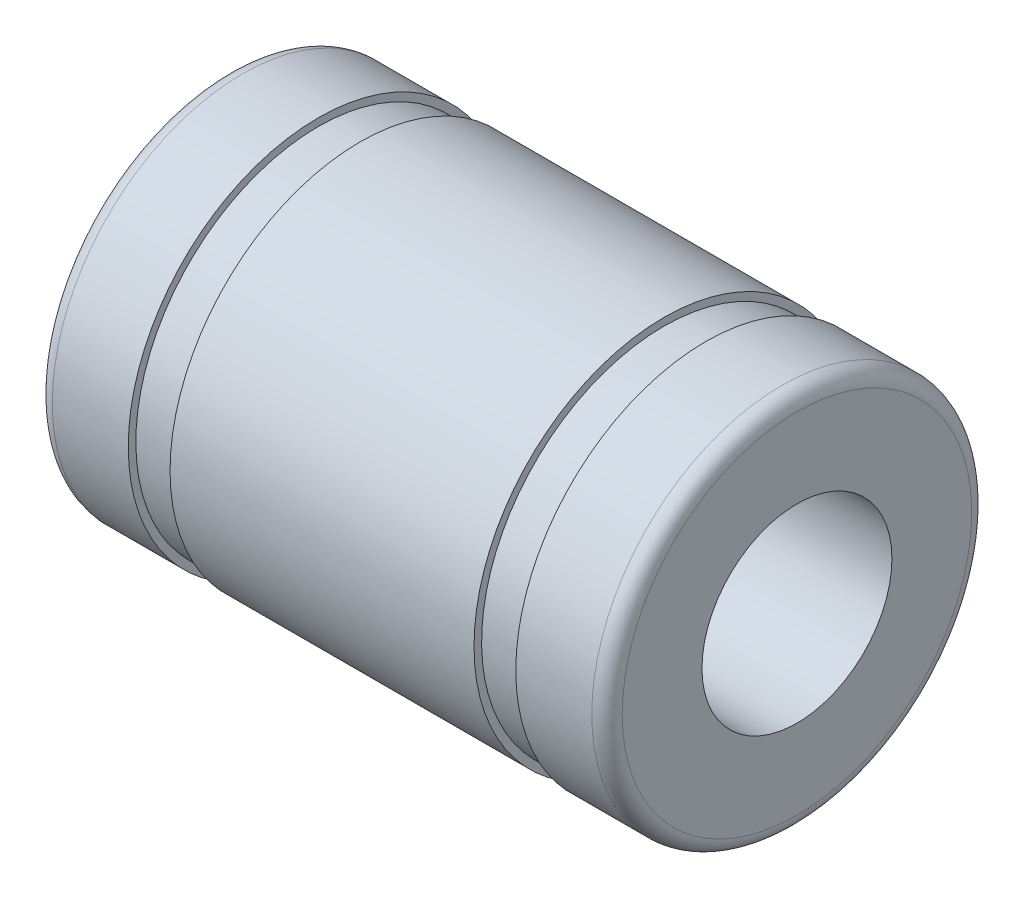
ISO-10303-21;
HEADER;
FILE_DESCRIPTION(('STEP AP214'),'2;1');
FILE_NAME('part.step','',(''),(''),'','','');
FILE_SCHEMA(('AUTOMOTIVE_DESIGN { 1 0 10303 214 1 1 1 1 }'));
ENDSEC;
DATA;
#1=APPLICATION_CONTEXT('core data for automotive mechanical design processes');
#2=APPLICATION_PROTOCOL_DEFINITION('international standard','automotive_design',2000,#1);
#3=PRODUCT_CONTEXT('',#1,'mechanical');
#4=PRODUCT('Part','Part','',(#3));
#5=PRODUCT_RELATED_PRODUCT_CATEGORY('part','',(#4));
#6=PRODUCT_DEFINITION_FORMATION('','',#4);
#7=PRODUCT_DEFINITION_CONTEXT('part definition',#1,'design');
#8=PRODUCT_DEFINITION('design','',#6,#7);
#9=PRODUCT_DEFINITION_SHAPE('','',#8);
#10=(LENGTH_UNIT() NAMED_UNIT(*) SI_UNIT(.MILLI.,.METRE.));
#11=(NAMED_UNIT(*) PLANE_ANGLE_UNIT() SI_UNIT($,.RADIAN.));
#12=(NAMED_UNIT(*) SI_UNIT($,.STERADIAN.) SOLID_ANGLE_UNIT());
#13=UNCERTAINTY_MEASURE_WITH_UNIT(LENGTH_MEASURE(1.E-05),#10,'distance_accuracy_value','');
#14=(GEOMETRIC_REPRESENTATION_CONTEXT(3) GLOBAL_UNCERTAINTY_ASSIGNED_CONTEXT((#13)) GLOBAL_UNIT_ASSIGNED_CONTEXT((#10,
#11,#12)) REPRESENTATION_CONTEXT('',''));
#15=CARTESIAN_POINT('',(0.,0.,0.));
#16=DIRECTION('',(0.,0.,1.));
#17=DIRECTION('',(1.,0.,0.));
#18=AXIS2_PLACEMENT_3D('',#15,#16,#17);
#19=CARTESIAN_POINT('',(0.,0.,0.));
#20=DIRECTION('',(-1.,0.,0.));
#21=DIRECTION('',(0.,0.,1.));
#22=AXIS2_PLACEMENT_3D('',#19,#20,#21);
#23=CYLINDRICAL_SURFACE('',#22,5.);
#24=CARTESIAN_POINT('',(2.4,0.,0.));
#25=DIRECTION('',(1.,0.,0.));
#26=DIRECTION('',(0.,1.,0.));
#27=AXIS2_PLACEMENT_3D('',#24,#25,#26);
#28=CIRCLE('',#27,5.00000000000001);
#29=CARTESIAN_POINT('',(2.4,5.00000000000001,0.));
#30=VERTEX_POINT('',#29);
#31=EDGE_CURVE('E82',#30,#30,#28,.T.);
#32=ORIENTED_EDGE('',*,*,#31,.F.);
#33=EDGE_LOOP('',(#32));
#34=FACE_BOUND('',#33,.T.);
#35=CARTESIAN_POINT('',(0.4,0.,0.));
#36=DIRECTION('',(1.,0.,0.));
#37=DIRECTION('',(0.,0.,-1.));
#38=AXIS2_PLACEMENT_3D('',#35,#36,#37);
#39=CIRCLE('',#38,5.);
#40=CARTESIAN_POINT('',(0.4,0.,-5.));
#41=VERTEX_POINT('',#40);
#42=EDGE_CURVE('E42',#41,#41,#39,.T.);
#43=ORIENTED_EDGE('',*,*,#42,.T.);
#44=EDGE_LOOP('',(#43));
#45=FACE_BOUND('',#44,.T.);
#46=ADVANCED_FACE('F35',(#34,#45),#23,.T.);
#47=CARTESIAN_POINT('',(3.5,0.,0.));
#48=DIRECTION('',(1.,0.,0.));
#49=DIRECTION('',(0.,1.,0.));
#50=AXIS2_PLACEMENT_3D('',#47,#48,#49);
#51=CIRCLE('',#50,5.00000000000001);
#52=CARTESIAN_POINT('',(3.5,5.00000000000001,0.));
#53=VERTEX_POINT('',#52);
#54=EDGE_CURVE('E79',#53,#53,#51,.T.);
#55=ORIENTED_EDGE('',*,*,#54,.T.);
#56=EDGE_LOOP('',(#55));
#57=FACE_BOUND('',#56,.T.);
#58=CARTESIAN_POINT('',(11.5,0.,0.));
#59=DIRECTION('',(1.,0.,0.));
#60=DIRECTION('',(0.,1.,0.));
#61=AXIS2_PLACEMENT_3D('',#58,#59,#60);
#62=CIRCLE('',#61,5.);
#63=CARTESIAN_POINT('',(11.5,5.00000000000001,0.));
#64=VERTEX_POINT('',#63);
#65=EDGE_CURVE('E70',#64,#64,#62,.T.);
#66=ORIENTED_EDGE('',*,*,#65,.F.);
#67=EDGE_LOOP('',(#66));
#68=FACE_BOUND('',#67,.T.);
#69=ADVANCED_FACE('F89',(#57,#68),#23,.T.);
#70=CARTESIAN_POINT('',(15.,2.5,0.));
#71=DIRECTION('',(-1.,0.,0.));
#72=DIRECTION('',(0.,0.,1.));
#73=AXIS2_PLACEMENT_3D('',#70,#71,#72);
#74=PLANE('',#73);
#75=CARTESIAN_POINT('',(15.,0.,0.));
#76=DIRECTION('',(-1.,0.,0.));
#77=DIRECTION('',(0.,0.,1.));
#78=AXIS2_PLACEMENT_3D('',#75,#76,#77);
#79=CIRCLE('',#78,4.6);
#80=CARTESIAN_POINT('',(15.,0.,4.6));
#81=VERTEX_POINT('',#80);
#82=EDGE_CURVE('E10',#81,#81,#79,.F.);
#83=ORIENTED_EDGE('',*,*,#82,.T.);
#84=EDGE_LOOP('',(#83));
#85=FACE_BOUND('',#84,.T.);
#86=CARTESIAN_POINT('',(15.,0.,0.));
#87=DIRECTION('',(-1.,0.,0.));
#88=DIRECTION('',(0.,0.,1.));
#89=AXIS2_PLACEMENT_3D('',#86,#87,#88);
#90=CIRCLE('',#89,2.5);
#91=CARTESIAN_POINT('',(15.,0.,2.5));
#92=VERTEX_POINT('',#91);
#93=EDGE_CURVE('E58',#92,#92,#90,.T.);
#94=ORIENTED_EDGE('',*,*,#93,.T.);
#95=EDGE_LOOP('',(#94));
#96=FACE_BOUND('',#95,.T.);
#97=ADVANCED_FACE('F95',(#85,#96),#74,.F.);
#98=CARTESIAN_POINT('',(12.6,0.,0.));
#99=DIRECTION('',(1.,0.,0.));
#100=DIRECTION('',(0.,1.,0.));
#101=AXIS2_PLACEMENT_3D('',#98,#99,#100);
#102=CIRCLE('',#101,5.00000000000001);
#103=CARTESIAN_POINT('',(12.6,5.00000000000001,0.));
#104=VERTEX_POINT('',#103);
#105=EDGE_CURVE('E67',#104,#104,#102,.T.);
#106=ORIENTED_EDGE('',*,*,#105,.T.);
#107=EDGE_LOOP('',(#106));
#108=FACE_BOUND('',#107,.T.);
#109=CARTESIAN_POINT('',(14.6,0.,0.));
#110=DIRECTION('',(-1.,0.,0.));
#111=DIRECTION('',(0.,0.,1.));
#112=AXIS2_PLACEMENT_3D('',#109,#110,#111);
#113=CIRCLE('',#112,5.);
#114=CARTESIAN_POINT('',(14.6,0.,5.));
#115=VERTEX_POINT('',#114);
#116=EDGE_CURVE('E46',#115,#115,#113,.T.);
#117=ORIENTED_EDGE('',*,*,#116,.T.);
#118=EDGE_LOOP('',(#117));
#119=FACE_BOUND('',#118,.T.);
#120=ADVANCED_FACE('F91',(#108,#119),#23,.T.);
#121=CARTESIAN_POINT('',(0.,2.5,0.));
#122=DIRECTION('',(1.,0.,0.));
#123=DIRECTION('',(0.,0.,-1.));
#124=AXIS2_PLACEMENT_3D('',#121,#122,#123);
#125=PLANE('',#124);
#126=CARTESIAN_POINT('',(0.,0.,0.));
#127=DIRECTION('',(1.,0.,0.));
#128=DIRECTION('',(0.,0.,-1.));
#129=AXIS2_PLACEMENT_3D('',#126,#127,#128);
#130=CIRCLE('',#129,4.6);
#131=CARTESIAN_POINT('',(0.,0.,-4.6));
#132=VERTEX_POINT('',#131);
#133=EDGE_CURVE('E50',#132,#132,#130,.F.);
#134=ORIENTED_EDGE('',*,*,#133,.T.);
#135=EDGE_LOOP('',(#134));
#136=FACE_BOUND('',#135,.T.);
#137=CARTESIAN_POINT('',(0.,0.,0.));
#138=DIRECTION('',(-1.,0.,0.));
#139=DIRECTION('',(0.,0.,1.));
#140=AXIS2_PLACEMENT_3D('',#137,#138,#139);
#141=CIRCLE('',#140,2.5);
#142=CARTESIAN_POINT('',(0.,0.,2.5));
#143=VERTEX_POINT('',#142);
#144=EDGE_CURVE('E55',#143,#143,#141,.T.);
#145=ORIENTED_EDGE('',*,*,#144,.F.);
#146=EDGE_LOOP('',(#145));
#147=FACE_BOUND('',#146,.T.);
#148=ADVANCED_FACE('F100',(#136,#147),#125,.F.);
#149=CARTESIAN_POINT('',(0.,0.,0.));
#150=DIRECTION('',(-1.,0.,0.));
#151=DIRECTION('',(0.,0.,1.));
#152=AXIS2_PLACEMENT_3D('',#149,#150,#151);
#153=CYLINDRICAL_SURFACE('',#152,2.5);
#154=ORIENTED_EDGE('',*,*,#93,.F.);
#155=EDGE_LOOP('',(#154));
#156=FACE_BOUND('',#155,.T.);
#157=ORIENTED_EDGE('',*,*,#144,.T.);
#158=EDGE_LOOP('',(#157));
#159=FACE_BOUND('',#158,.T.);
#160=ADVANCED_FACE('F106',(#156,#159),#153,.F.);
#161=CARTESIAN_POINT('',(0.4,0.,0.));
#162=DIRECTION('',(1.,0.,0.));
#163=DIRECTION('',(0.,0.,-1.));
#164=AXIS2_PLACEMENT_3D('',#161,#162,#163);
#165=TOROIDAL_SURFACE('',#164,4.6,0.4);
#166=ORIENTED_EDGE('',*,*,#42,.F.);
#167=EDGE_LOOP('',(#166));
#168=FACE_BOUND('',#167,.T.);
#169=ORIENTED_EDGE('',*,*,#133,.F.);
#170=EDGE_LOOP('',(#169));
#171=FACE_BOUND('',#170,.T.);
#172=ADVANCED_FACE('F114',(#168,#171),#165,.T.);
#173=CARTESIAN_POINT('',(14.6,0.,0.));
#174=DIRECTION('',(-1.,0.,0.));
#175=DIRECTION('',(0.,0.,1.));
#176=AXIS2_PLACEMENT_3D('',#173,#174,#175);
#177=TOROIDAL_SURFACE('',#176,4.6,0.4);
#178=ORIENTED_EDGE('',*,*,#82,.F.);
#179=EDGE_LOOP('',(#178));
#180=FACE_BOUND('',#179,.T.);
#181=ORIENTED_EDGE('',*,*,#116,.F.);
#182=EDGE_LOOP('',(#181));
#183=FACE_BOUND('',#182,.T.);
#184=ADVANCED_FACE('F37',(#180,#183),#177,.T.);
#185=CARTESIAN_POINT('',(11.5,5.00000000000001,0.));
#186=DIRECTION('',(-1.,0.,0.));
#187=DIRECTION('',(0.,-1.,0.));
#188=AXIS2_PLACEMENT_3D('',#185,#186,#187);
#189=PLANE('',#188);
#190=CARTESIAN_POINT('',(11.5,0.,0.));
#191=DIRECTION('',(1.,0.,0.));
#192=DIRECTION('',(0.,1.,0.));
#193=AXIS2_PLACEMENT_3D('',#190,#191,#192);
#194=CIRCLE('',#193,4.8);
#195=CARTESIAN_POINT('',(11.5,4.8,0.));
#196=VERTEX_POINT('',#195);
#197=EDGE_CURVE('E61',#196,#196,#194,.T.);
#198=ORIENTED_EDGE('',*,*,#197,.F.);
#199=EDGE_LOOP('',(#198));
#200=FACE_BOUND('',#199,.T.);
#201=ORIENTED_EDGE('',*,*,#65,.T.);
#202=EDGE_LOOP('',(#201));
#203=FACE_BOUND('',#202,.T.);
#204=ADVANCED_FACE('F113',(#200,#203),#189,.F.);
#205=CARTESIAN_POINT('',(15.,0.,0.));
#206=DIRECTION('',(1.,0.,0.));
#207=DIRECTION('',(0.,1.,0.));
#208=AXIS2_PLACEMENT_3D('',#205,#206,#207);
#209=CYLINDRICAL_SURFACE('',#208,4.8);
#210=CARTESIAN_POINT('',(12.6,0.,0.));
#211=DIRECTION('',(1.,0.,0.));
#212=DIRECTION('',(0.,1.,0.));
#213=AXIS2_PLACEMENT_3D('',#210,#211,#212);
#214=CIRCLE('',#213,4.8);
#215=CARTESIAN_POINT('',(12.6,4.8,0.));
#216=VERTEX_POINT('',#215);
#217=EDGE_CURVE('E64',#216,#216,#214,.T.);
#218=ORIENTED_EDGE('',*,*,#217,.F.);
#219=EDGE_LOOP('',(#218));
#220=FACE_BOUND('',#219,.T.);
#221=ORIENTED_EDGE('',*,*,#197,.T.);
#222=EDGE_LOOP('',(#221));
#223=FACE_BOUND('',#222,.T.);
#224=ADVANCED_FACE('F120',(#220,#223),#209,.T.);
#225=CARTESIAN_POINT('',(12.6,5.00000000000001,0.));
#226=DIRECTION('',(1.,0.,0.));
#227=DIRECTION('',(0.,1.,0.));
#228=AXIS2_PLACEMENT_3D('',#225,#226,#227);
#229=PLANE('',#228);
#230=ORIENTED_EDGE('',*,*,#105,.F.);
#231=EDGE_LOOP('',(#230));
#232=FACE_BOUND('',#231,.T.);
#233=ORIENTED_EDGE('',*,*,#217,.T.);
#234=EDGE_LOOP('',(#233));
#235=FACE_BOUND('',#234,.T.);
#236=ADVANCED_FACE('F140',(#232,#235),#229,.F.);
#237=CARTESIAN_POINT('',(2.4,5.00000000000001,0.));
#238=DIRECTION('',(-1.,0.,0.));
#239=DIRECTION('',(0.,-1.,0.));
#240=AXIS2_PLACEMENT_3D('',#237,#238,#239);
#241=PLANE('',#240);
#242=CARTESIAN_POINT('',(2.4,0.,0.));
#243=DIRECTION('',(1.,0.,0.));
#244=DIRECTION('',(0.,1.,0.));
#245=AXIS2_PLACEMENT_3D('',#242,#243,#244);
#246=CIRCLE('',#245,4.8);
#247=CARTESIAN_POINT('',(2.4,4.8,0.));
#248=VERTEX_POINT('',#247);
#249=EDGE_CURVE('E73',#248,#248,#246,.T.);
#250=ORIENTED_EDGE('',*,*,#249,.F.);
#251=EDGE_LOOP('',(#250));
#252=FACE_BOUND('',#251,.T.);
#253=ORIENTED_EDGE('',*,*,#31,.T.);
#254=EDGE_LOOP('',(#253));
#255=FACE_BOUND('',#254,.T.);
#256=ADVANCED_FACE('F86',(#252,#255),#241,.F.);
#257=CARTESIAN_POINT('',(15.,0.,0.));
#258=DIRECTION('',(1.,0.,0.));
#259=DIRECTION('',(0.,1.,0.));
#260=AXIS2_PLACEMENT_3D('',#257,#258,#259);
#261=CYLINDRICAL_SURFACE('',#260,4.8);
#262=CARTESIAN_POINT('',(3.5,0.,0.));
#263=DIRECTION('',(1.,0.,0.));
#264=DIRECTION('',(0.,1.,0.));
#265=AXIS2_PLACEMENT_3D('',#262,#263,#264);
#266=CIRCLE('',#265,4.8);
#267=CARTESIAN_POINT('',(3.5,4.8,0.));
#268=VERTEX_POINT('',#267);
#269=EDGE_CURVE('E76',#268,#268,#266,.T.);
#270=ORIENTED_EDGE('',*,*,#269,.F.);
#271=EDGE_LOOP('',(#270));
#272=FACE_BOUND('',#271,.T.);
#273=ORIENTED_EDGE('',*,*,#249,.T.);
#274=EDGE_LOOP('',(#273));
#275=FACE_BOUND('',#274,.T.);
#276=ADVANCED_FACE('F147',(#272,#275),#261,.T.);
#277=CARTESIAN_POINT('',(3.5,5.00000000000001,0.));
#278=DIRECTION('',(1.,0.,0.));
#279=DIRECTION('',(0.,1.,0.));
#280=AXIS2_PLACEMENT_3D('',#277,#278,#279);
#281=PLANE('',#280);
#282=ORIENTED_EDGE('',*,*,#54,.F.);
#283=EDGE_LOOP('',(#282));
#284=FACE_BOUND('',#283,.T.);
#285=ORIENTED_EDGE('',*,*,#269,.T.);
#286=EDGE_LOOP('',(#285));
#287=FACE_BOUND('',#286,.T.);
#288=ADVANCED_FACE('F151',(#284,#287),#281,.F.);
#289=CLOSED_SHELL('',(#46,#69,#97,#120,#148,#160,#172,#184,#204,#224,#236,#256,#276,#288));
#290=MANIFOLD_SOLID_BREP('B2',#289);
#291=ADVANCED_BREP_SHAPE_REPRESENTATION('',(#18,#290),#14);
#292=SHAPE_DEFINITION_REPRESENTATION(#9,#291);
ENDSEC;
END-ISO-10303-21;
